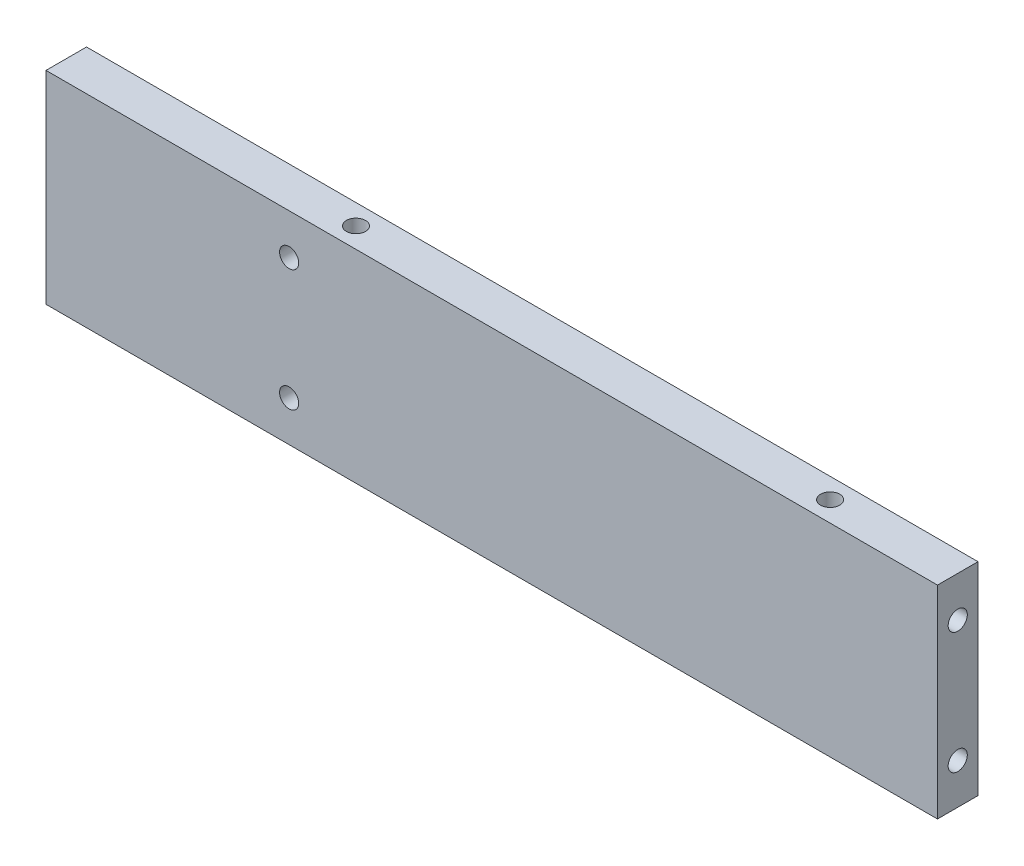
ISO-10303-21;
HEADER;
FILE_DESCRIPTION(('STEP AP214'),'2;1');
FILE_NAME('part.step','',(''),(''),'','','');
FILE_SCHEMA(('AUTOMOTIVE_DESIGN { 1 0 10303 214 1 1 1 1 }'));
ENDSEC;
DATA;
#1=APPLICATION_CONTEXT('core data for automotive mechanical design processes');
#2=APPLICATION_PROTOCOL_DEFINITION('international standard','automotive_design',2000,#1);
#3=PRODUCT_CONTEXT('',#1,'mechanical');
#4=PRODUCT('Part','Part','',(#3));
#5=PRODUCT_RELATED_PRODUCT_CATEGORY('part','',(#4));
#6=PRODUCT_DEFINITION_FORMATION('','',#4);
#7=PRODUCT_DEFINITION_CONTEXT('part definition',#1,'design');
#8=PRODUCT_DEFINITION('design','',#6,#7);
#9=PRODUCT_DEFINITION_SHAPE('','',#8);
#10=(LENGTH_UNIT() NAMED_UNIT(*) SI_UNIT(.MILLI.,.METRE.));
#11=(NAMED_UNIT(*) PLANE_ANGLE_UNIT() SI_UNIT($,.RADIAN.));
#12=(NAMED_UNIT(*) SI_UNIT($,.STERADIAN.) SOLID_ANGLE_UNIT());
#13=UNCERTAINTY_MEASURE_WITH_UNIT(LENGTH_MEASURE(1.E-05),#10,'distance_accuracy_value','');
#14=(GEOMETRIC_REPRESENTATION_CONTEXT(3) GLOBAL_UNCERTAINTY_ASSIGNED_CONTEXT((#13)) GLOBAL_UNIT_ASSIGNED_CONTEXT((#10,
#11,#12)) REPRESENTATION_CONTEXT('',''));
#15=CARTESIAN_POINT('',(0.,0.,0.));
#16=DIRECTION('',(0.,0.,1.));
#17=DIRECTION('',(1.,0.,0.));
#18=AXIS2_PLACEMENT_3D('',#15,#16,#17);
#19=CARTESIAN_POINT('',(0.,31.75,0.));
#20=DIRECTION('',(0.,0.,-1.));
#21=DIRECTION('',(-1.,0.,0.));
#22=AXIS2_PLACEMENT_3D('',#19,#20,#21);
#23=PLANE('',#22);
#24=CARTESIAN_POINT('',(38.1,6.35,0.));
#25=DIRECTION('',(0.,0.,-1.));
#26=DIRECTION('',(-1.,0.,0.));
#27=AXIS2_PLACEMENT_3D('',#24,#25,#26);
#28=CIRCLE('',#27,1.5);
#29=CARTESIAN_POINT('',(36.6,6.35,0.));
#30=VERTEX_POINT('',#29);
#31=EDGE_CURVE('E252',#30,#30,#28,.T.);
#32=ORIENTED_EDGE('',*,*,#31,.F.);
#33=EDGE_LOOP('',(#32));
#34=FACE_BOUND('',#33,.T.);
#35=CARTESIAN_POINT('',(38.1,25.4,0.));
#36=DIRECTION('',(0.,0.,-1.));
#37=DIRECTION('',(-1.,0.,0.));
#38=AXIS2_PLACEMENT_3D('',#35,#36,#37);
#39=CIRCLE('',#38,1.5);
#40=CARTESIAN_POINT('',(36.6,25.4,0.));
#41=VERTEX_POINT('',#40);
#42=EDGE_CURVE('E258',#41,#41,#39,.T.);
#43=ORIENTED_EDGE('',*,*,#42,.F.);
#44=EDGE_LOOP('',(#43));
#45=FACE_BOUND('',#44,.T.);
#46=DIRECTION('',(1.,0.,0.));
#47=VECTOR('',#46,1.);
#48=CARTESIAN_POINT('',(0.,0.,0.));
#49=LINE('',#48,#47);
#50=CARTESIAN_POINT('',(0.,0.,0.));
#51=VERTEX_POINT('',#50);
#52=CARTESIAN_POINT('',(139.7,0.,0.));
#53=VERTEX_POINT('',#52);
#54=EDGE_CURVE('E269',#51,#53,#49,.T.);
#55=ORIENTED_EDGE('',*,*,#54,.F.);
#56=DIRECTION('',(0.,-1.,0.));
#57=VECTOR('',#56,1.);
#58=CARTESIAN_POINT('',(0.,31.75,0.));
#59=LINE('',#58,#57);
#60=CARTESIAN_POINT('',(0.,31.75,0.));
#61=VERTEX_POINT('',#60);
#62=EDGE_CURVE('E277',#61,#51,#59,.T.);
#63=ORIENTED_EDGE('',*,*,#62,.F.);
#64=DIRECTION('',(1.,0.,0.));
#65=VECTOR('',#64,1.);
#66=CARTESIAN_POINT('',(0.,31.75,0.));
#67=LINE('',#66,#65);
#68=CARTESIAN_POINT('',(139.7,31.75,0.));
#69=VERTEX_POINT('',#68);
#70=EDGE_CURVE('E274',#61,#69,#67,.T.);
#71=ORIENTED_EDGE('',*,*,#70,.T.);
#72=DIRECTION('',(0.,-1.,0.));
#73=VECTOR('',#72,1.);
#74=CARTESIAN_POINT('',(139.7,31.75,0.));
#75=LINE('',#74,#73);
#76=EDGE_CURVE('E289',#69,#53,#75,.T.);
#77=ORIENTED_EDGE('',*,*,#76,.T.);
#78=EDGE_LOOP('',(#55,#63,#71,#77));
#79=FACE_BOUND('',#78,.T.);
#80=DIRECTION('',(0.,1.,0.));
#81=VECTOR('',#80,1.);
#82=CARTESIAN_POINT('',(35.56,20.955,0.));
#83=LINE('',#82,#81);
#84=CARTESIAN_POINT('',(35.56,20.955,0.));
#85=VERTEX_POINT('',#84);
#86=CARTESIAN_POINT('',(35.56,23.495,0.));
#87=VERTEX_POINT('',#86);
#88=EDGE_CURVE('E243',#85,#87,#83,.T.);
#89=ORIENTED_EDGE('',*,*,#88,.T.);
#90=CARTESIAN_POINT('',(30.48,23.495,0.));
#91=DIRECTION('',(0.,0.,-1.));
#92=DIRECTION('',(-1.,0.,0.));
#93=AXIS2_PLACEMENT_3D('',#90,#91,#92);
#94=CIRCLE('',#93,5.08);
#95=CARTESIAN_POINT('',(30.48,28.575,0.));
#96=VERTEX_POINT('',#95);
#97=EDGE_CURVE('E11',#87,#96,#94,.F.);
#98=ORIENTED_EDGE('',*,*,#97,.T.);
#99=DIRECTION('',(-1.,0.,0.));
#100=VECTOR('',#99,1.);
#101=CARTESIAN_POINT('',(10.16,28.575,0.));
#102=LINE('',#101,#100);
#103=CARTESIAN_POINT('',(15.24,28.575,0.));
#104=VERTEX_POINT('',#103);
#105=EDGE_CURVE('E216',#96,#104,#102,.T.);
#106=ORIENTED_EDGE('',*,*,#105,.T.);
#107=CARTESIAN_POINT('',(15.24,23.495,0.));
#108=DIRECTION('',(0.,0.,-1.));
#109=DIRECTION('',(-1.,0.,0.));
#110=AXIS2_PLACEMENT_3D('',#107,#108,#109);
#111=CIRCLE('',#110,5.08);
#112=CARTESIAN_POINT('',(10.16,23.495,0.));
#113=VERTEX_POINT('',#112);
#114=EDGE_CURVE('E333',#104,#113,#111,.F.);
#115=ORIENTED_EDGE('',*,*,#114,.T.);
#116=DIRECTION('',(0.,-1.,0.));
#117=VECTOR('',#116,1.);
#118=CARTESIAN_POINT('',(10.16,28.575,0.));
#119=LINE('',#118,#117);
#120=CARTESIAN_POINT('',(10.16,8.25500000000001,0.));
#121=VERTEX_POINT('',#120);
#122=EDGE_CURVE('E211',#113,#121,#119,.T.);
#123=ORIENTED_EDGE('',*,*,#122,.T.);
#124=CARTESIAN_POINT('',(15.24,8.25500000000001,0.));
#125=DIRECTION('',(0.,0.,-1.));
#126=DIRECTION('',(-1.,0.,0.));
#127=AXIS2_PLACEMENT_3D('',#124,#125,#126);
#128=CIRCLE('',#127,5.08);
#129=CARTESIAN_POINT('',(15.24,3.175,0.));
#130=VERTEX_POINT('',#129);
#131=EDGE_CURVE('E331',#121,#130,#128,.F.);
#132=ORIENTED_EDGE('',*,*,#131,.T.);
#133=DIRECTION('',(1.,0.,0.));
#134=VECTOR('',#133,1.);
#135=CARTESIAN_POINT('',(10.16,3.175,0.));
#136=LINE('',#135,#134);
#137=CARTESIAN_POINT('',(30.48,3.175,0.));
#138=VERTEX_POINT('',#137);
#139=EDGE_CURVE('E234',#130,#138,#136,.T.);
#140=ORIENTED_EDGE('',*,*,#139,.T.);
#141=CARTESIAN_POINT('',(30.48,8.255,0.));
#142=DIRECTION('',(0.,0.,-1.));
#143=DIRECTION('',(-1.,0.,0.));
#144=AXIS2_PLACEMENT_3D('',#141,#142,#143);
#145=CIRCLE('',#144,5.08);
#146=CARTESIAN_POINT('',(35.56,8.255,0.));
#147=VERTEX_POINT('',#146);
#148=EDGE_CURVE('E335',#138,#147,#145,.F.);
#149=ORIENTED_EDGE('',*,*,#148,.T.);
#150=DIRECTION('',(0.,1.,0.));
#151=VECTOR('',#150,1.);
#152=CARTESIAN_POINT('',(35.56,10.795,0.));
#153=LINE('',#152,#151);
#154=CARTESIAN_POINT('',(35.56,10.795,0.));
#155=VERTEX_POINT('',#154);
#156=EDGE_CURVE('E237',#147,#155,#153,.T.);
#157=ORIENTED_EDGE('',*,*,#156,.T.);
#158=CARTESIAN_POINT('',(33.02,15.1944090512249,0.));
#159=DIRECTION('',(0.,0.,-1.));
#160=DIRECTION('',(-1.,0.,0.));
#161=AXIS2_PLACEMENT_3D('',#158,#159,#160);
#162=CIRCLE('',#161,5.08);
#163=CARTESIAN_POINT('',(38.1,15.1944090512249,0.));
#164=VERTEX_POINT('',#163);
#165=EDGE_CURVE('E337',#155,#164,#162,.F.);
#166=ORIENTED_EDGE('',*,*,#165,.T.);
#167=DIRECTION('',(0.,1.,0.));
#168=VECTOR('',#167,1.);
#169=CARTESIAN_POINT('',(38.1,20.955,0.));
#170=LINE('',#169,#168);
#171=CARTESIAN_POINT('',(38.1,16.5555909487751,0.));
#172=VERTEX_POINT('',#171);
#173=EDGE_CURVE('E240',#164,#172,#170,.T.);
#174=ORIENTED_EDGE('',*,*,#173,.T.);
#175=CARTESIAN_POINT('',(33.02,16.5555909487751,0.));
#176=DIRECTION('',(0.,0.,-1.));
#177=DIRECTION('',(-1.,0.,0.));
#178=AXIS2_PLACEMENT_3D('',#175,#176,#177);
#179=CIRCLE('',#178,5.08);
#180=EDGE_CURVE('E46',#172,#85,#179,.F.);
#181=ORIENTED_EDGE('',*,*,#180,.T.);
#182=EDGE_LOOP('',(#89,#98,#106,#115,#123,#132,#140,#149,#157,#166,#174,#181));
#183=FACE_BOUND('',#182,.T.);
#184=ADVANCED_FACE('F38',(#34,#45,#79,#183),#23,.T.);
#185=CARTESIAN_POINT('',(0.,31.75,0.));
#186=DIRECTION('',(1.,0.,0.));
#187=DIRECTION('',(0.,0.,-1.));
#188=AXIS2_PLACEMENT_3D('',#185,#186,#187);
#189=PLANE('',#188);
#190=CARTESIAN_POINT('',(0.,25.4,3.175));
#191=DIRECTION('',(-1.,0.,0.));
#192=DIRECTION('',(0.,0.,1.));
#193=AXIS2_PLACEMENT_3D('',#190,#191,#192);
#194=CIRCLE('',#193,1.5);
#195=CARTESIAN_POINT('',(0.,25.4,4.675));
#196=VERTEX_POINT('',#195);
#197=EDGE_CURVE('E199',#196,#196,#194,.T.);
#198=ORIENTED_EDGE('',*,*,#197,.F.);
#199=EDGE_LOOP('',(#198));
#200=FACE_BOUND('',#199,.T.);
#201=CARTESIAN_POINT('',(0.,6.35,3.175));
#202=DIRECTION('',(-1.,0.,0.));
#203=DIRECTION('',(0.,0.,1.));
#204=AXIS2_PLACEMENT_3D('',#201,#202,#203);
#205=CIRCLE('',#204,1.5);
#206=CARTESIAN_POINT('',(0.,6.35,4.675));
#207=VERTEX_POINT('',#206);
#208=EDGE_CURVE('E205',#207,#207,#205,.T.);
#209=ORIENTED_EDGE('',*,*,#208,.F.);
#210=EDGE_LOOP('',(#209));
#211=FACE_BOUND('',#210,.T.);
#212=DIRECTION('',(0.,0.,1.));
#213=VECTOR('',#212,1.);
#214=CARTESIAN_POINT('',(0.,0.,0.));
#215=LINE('',#214,#213);
#216=CARTESIAN_POINT('',(0.,0.,6.35));
#217=VERTEX_POINT('',#216);
#218=EDGE_CURVE('E264',#51,#217,#215,.T.);
#219=ORIENTED_EDGE('',*,*,#218,.T.);
#220=DIRECTION('',(0.,-1.,0.));
#221=VECTOR('',#220,1.);
#222=CARTESIAN_POINT('',(0.,31.75,6.35));
#223=LINE('',#222,#221);
#224=CARTESIAN_POINT('',(0.,31.75,6.35));
#225=VERTEX_POINT('',#224);
#226=EDGE_CURVE('E293',#225,#217,#223,.T.);
#227=ORIENTED_EDGE('',*,*,#226,.F.);
#228=DIRECTION('',(0.,0.,1.));
#229=VECTOR('',#228,1.);
#230=CARTESIAN_POINT('',(0.,31.75,0.));
#231=LINE('',#230,#229);
#232=EDGE_CURVE('E265',#61,#225,#231,.T.);
#233=ORIENTED_EDGE('',*,*,#232,.F.);
#234=ORIENTED_EDGE('',*,*,#62,.T.);
#235=EDGE_LOOP('',(#219,#227,#233,#234));
#236=FACE_BOUND('',#235,.T.);
#237=ADVANCED_FACE('F398',(#200,#211,#236),#189,.F.);
#238=CARTESIAN_POINT('',(0.,31.75,6.35));
#239=DIRECTION('',(0.,0.,-1.));
#240=DIRECTION('',(-1.,0.,0.));
#241=AXIS2_PLACEMENT_3D('',#238,#239,#240);
#242=PLANE('',#241);
#243=CARTESIAN_POINT('',(38.1,6.35,6.35));
#244=DIRECTION('',(0.,0.,-1.));
#245=DIRECTION('',(-1.,0.,0.));
#246=AXIS2_PLACEMENT_3D('',#243,#244,#245);
#247=CIRCLE('',#246,1.5);
#248=CARTESIAN_POINT('',(36.6,6.35,6.35));
#249=VERTEX_POINT('',#248);
#250=EDGE_CURVE('E255',#249,#249,#247,.T.);
#251=ORIENTED_EDGE('',*,*,#250,.T.);
#252=EDGE_LOOP('',(#251));
#253=FACE_BOUND('',#252,.T.);
#254=CARTESIAN_POINT('',(38.1,25.4,6.35));
#255=DIRECTION('',(0.,0.,-1.));
#256=DIRECTION('',(-1.,0.,0.));
#257=AXIS2_PLACEMENT_3D('',#254,#255,#256);
#258=CIRCLE('',#257,1.5);
#259=CARTESIAN_POINT('',(36.6,25.4,6.35));
#260=VERTEX_POINT('',#259);
#261=EDGE_CURVE('E261',#260,#260,#258,.T.);
#262=ORIENTED_EDGE('',*,*,#261,.T.);
#263=EDGE_LOOP('',(#262));
#264=FACE_BOUND('',#263,.T.);
#265=DIRECTION('',(1.,0.,0.));
#266=VECTOR('',#265,1.);
#267=CARTESIAN_POINT('',(0.,0.,6.35));
#268=LINE('',#267,#266);
#269=CARTESIAN_POINT('',(139.7,0.,6.35));
#270=VERTEX_POINT('',#269);
#271=EDGE_CURVE('E280',#217,#270,#268,.T.);
#272=ORIENTED_EDGE('',*,*,#271,.T.);
#273=DIRECTION('',(0.,-1.,0.));
#274=VECTOR('',#273,1.);
#275=CARTESIAN_POINT('',(139.7,31.75,6.35));
#276=LINE('',#275,#274);
#277=CARTESIAN_POINT('',(139.7,31.75,6.35));
#278=VERTEX_POINT('',#277);
#279=EDGE_CURVE('E291',#278,#270,#276,.T.);
#280=ORIENTED_EDGE('',*,*,#279,.F.);
#281=DIRECTION('',(1.,0.,0.));
#282=VECTOR('',#281,1.);
#283=CARTESIAN_POINT('',(0.,31.75,6.35));
#284=LINE('',#283,#282);
#285=EDGE_CURVE('E268',#225,#278,#284,.T.);
#286=ORIENTED_EDGE('',*,*,#285,.F.);
#287=ORIENTED_EDGE('',*,*,#226,.T.);
#288=EDGE_LOOP('',(#272,#280,#286,#287));
#289=FACE_BOUND('',#288,.T.);
#290=ADVANCED_FACE('F404',(#253,#264,#289),#242,.F.);
#291=CARTESIAN_POINT('',(139.7,31.75,0.));
#292=DIRECTION('',(1.,0.,0.));
#293=DIRECTION('',(0.,0.,-1.));
#294=AXIS2_PLACEMENT_3D('',#291,#292,#293);
#295=PLANE('',#294);
#296=CARTESIAN_POINT('',(139.7,25.4,3.17499999999999));
#297=DIRECTION('',(1.,0.,0.));
#298=DIRECTION('',(0.,0.,-1.));
#299=AXIS2_PLACEMENT_3D('',#296,#297,#298);
#300=CIRCLE('',#299,1.5);
#301=CARTESIAN_POINT('',(139.7,25.4,1.67499999999999));
#302=VERTEX_POINT('',#301);
#303=EDGE_CURVE('E187',#302,#302,#300,.T.);
#304=ORIENTED_EDGE('',*,*,#303,.F.);
#305=EDGE_LOOP('',(#304));
#306=FACE_BOUND('',#305,.T.);
#307=CARTESIAN_POINT('',(139.7,6.35,3.17499999999999));
#308=DIRECTION('',(1.,0.,0.));
#309=DIRECTION('',(0.,0.,-1.));
#310=AXIS2_PLACEMENT_3D('',#307,#308,#309);
#311=CIRCLE('',#310,1.5);
#312=CARTESIAN_POINT('',(139.7,6.35,1.67499999999999));
#313=VERTEX_POINT('',#312);
#314=EDGE_CURVE('E193',#313,#313,#311,.T.);
#315=ORIENTED_EDGE('',*,*,#314,.F.);
#316=EDGE_LOOP('',(#315));
#317=FACE_BOUND('',#316,.T.);
#318=DIRECTION('',(0.,0.,1.));
#319=VECTOR('',#318,1.);
#320=CARTESIAN_POINT('',(139.7,0.,0.));
#321=LINE('',#320,#319);
#322=EDGE_CURVE('E283',#53,#270,#321,.T.);
#323=ORIENTED_EDGE('',*,*,#322,.F.);
#324=ORIENTED_EDGE('',*,*,#76,.F.);
#325=DIRECTION('',(0.,0.,1.));
#326=VECTOR('',#325,1.);
#327=CARTESIAN_POINT('',(139.7,31.75,0.));
#328=LINE('',#327,#326);
#329=EDGE_CURVE('E271',#69,#278,#328,.T.);
#330=ORIENTED_EDGE('',*,*,#329,.T.);
#331=ORIENTED_EDGE('',*,*,#279,.T.);
#332=EDGE_LOOP('',(#323,#324,#330,#331));
#333=FACE_BOUND('',#332,.T.);
#334=ADVANCED_FACE('F413',(#306,#317,#333),#295,.T.);
#335=CARTESIAN_POINT('',(0.,31.75,0.));
#336=DIRECTION('',(0.,1.,0.));
#337=DIRECTION('',(0.,0.,1.));
#338=AXIS2_PLACEMENT_3D('',#335,#336,#337);
#339=PLANE('',#338);
#340=CARTESIAN_POINT('',(119.7,31.75,3.17500000000003));
#341=DIRECTION('',(0.,1.,0.));
#342=DIRECTION('',(0.,0.,1.));
#343=AXIS2_PLACEMENT_3D('',#340,#341,#342);
#344=CIRCLE('',#343,1.49999999999999);
#345=CARTESIAN_POINT('',(119.7,31.75,4.67500000000001));
#346=VERTEX_POINT('',#345);
#347=EDGE_CURVE('E177',#346,#346,#344,.T.);
#348=ORIENTED_EDGE('',*,*,#347,.F.);
#349=EDGE_LOOP('',(#348));
#350=FACE_BOUND('',#349,.T.);
#351=CARTESIAN_POINT('',(45.4,31.75,3.17500000000002));
#352=DIRECTION('',(0.,1.,0.));
#353=DIRECTION('',(0.,0.,1.));
#354=AXIS2_PLACEMENT_3D('',#351,#352,#353);
#355=CIRCLE('',#354,1.49999999999999);
#356=CARTESIAN_POINT('',(45.4,31.75,4.67500000000001));
#357=VERTEX_POINT('',#356);
#358=EDGE_CURVE('E176',#357,#357,#355,.T.);
#359=ORIENTED_EDGE('',*,*,#358,.F.);
#360=EDGE_LOOP('',(#359));
#361=FACE_BOUND('',#360,.T.);
#362=ORIENTED_EDGE('',*,*,#232,.T.);
#363=ORIENTED_EDGE('',*,*,#285,.T.);
#364=ORIENTED_EDGE('',*,*,#329,.F.);
#365=ORIENTED_EDGE('',*,*,#70,.F.);
#366=EDGE_LOOP('',(#362,#363,#364,#365));
#367=FACE_BOUND('',#366,.T.);
#368=ADVANCED_FACE('F416',(#350,#361,#367),#339,.T.);
#369=CARTESIAN_POINT('',(0.,0.,0.));
#370=DIRECTION('',(0.,1.,0.));
#371=DIRECTION('',(0.,0.,1.));
#372=AXIS2_PLACEMENT_3D('',#369,#370,#371);
#373=PLANE('',#372);
#374=ORIENTED_EDGE('',*,*,#218,.F.);
#375=ORIENTED_EDGE('',*,*,#54,.T.);
#376=ORIENTED_EDGE('',*,*,#322,.T.);
#377=ORIENTED_EDGE('',*,*,#271,.F.);
#378=EDGE_LOOP('',(#374,#375,#376,#377));
#379=FACE_BOUND('',#378,.T.);
#380=ADVANCED_FACE('F411',(#379),#373,.F.);
#381=CARTESIAN_POINT('',(38.1,25.4,0.));
#382=DIRECTION('',(0.,0.,-1.));
#383=DIRECTION('',(-1.,0.,0.));
#384=AXIS2_PLACEMENT_3D('',#381,#382,#383);
#385=CYLINDRICAL_SURFACE('',#384,1.5);
#386=ORIENTED_EDGE('',*,*,#261,.F.);
#387=EDGE_LOOP('',(#386));
#388=FACE_BOUND('',#387,.T.);
#389=ORIENTED_EDGE('',*,*,#42,.T.);
#390=EDGE_LOOP('',(#389));
#391=FACE_BOUND('',#390,.T.);
#392=ADVANCED_FACE('F692',(#388,#391),#385,.F.);
#393=CARTESIAN_POINT('',(38.1,6.35,0.));
#394=DIRECTION('',(0.,0.,-1.));
#395=DIRECTION('',(-1.,0.,0.));
#396=AXIS2_PLACEMENT_3D('',#393,#394,#395);
#397=CYLINDRICAL_SURFACE('',#396,1.5);
#398=ORIENTED_EDGE('',*,*,#250,.F.);
#399=EDGE_LOOP('',(#398));
#400=FACE_BOUND('',#399,.T.);
#401=ORIENTED_EDGE('',*,*,#31,.T.);
#402=EDGE_LOOP('',(#401));
#403=FACE_BOUND('',#402,.T.);
#404=ADVANCED_FACE('F676',(#400,#403),#397,.F.);
#405=CARTESIAN_POINT('',(10.16,28.575,3.81));
#406=DIRECTION('',(1.,0.,0.));
#407=DIRECTION('',(0.,0.,-1.));
#408=AXIS2_PLACEMENT_3D('',#405,#406,#407);
#409=PLANE('',#408);
#410=DIRECTION('',(0.,-1.,0.));
#411=VECTOR('',#410,1.);
#412=CARTESIAN_POINT('',(10.16,28.575,3.81));
#413=LINE('',#412,#411);
#414=CARTESIAN_POINT('',(10.16,23.495,3.81));
#415=VERTEX_POINT('',#414);
#416=CARTESIAN_POINT('',(10.16,8.25500000000001,3.81));
#417=VERTEX_POINT('',#416);
#418=EDGE_CURVE('E212',#415,#417,#413,.T.);
#419=ORIENTED_EDGE('',*,*,#418,.T.);
#420=DIRECTION('',(0.,0.,-1.));
#421=VECTOR('',#420,1.);
#422=CARTESIAN_POINT('',(10.16,8.25500000000001,0.));
#423=LINE('',#422,#421);
#424=EDGE_CURVE('E298',#417,#121,#423,.T.);
#425=ORIENTED_EDGE('',*,*,#424,.T.);
#426=ORIENTED_EDGE('',*,*,#122,.F.);
#427=DIRECTION('',(0.,0.,-1.));
#428=VECTOR('',#427,1.);
#429=CARTESIAN_POINT('',(10.16,23.495,3.81));
#430=LINE('',#429,#428);
#431=EDGE_CURVE('E296',#113,#415,#430,.F.);
#432=ORIENTED_EDGE('',*,*,#431,.T.);
#433=EDGE_LOOP('',(#419,#425,#426,#432));
#434=FACE_BOUND('',#433,.T.);
#435=ADVANCED_FACE('F377',(#434),#409,.T.);
#436=CARTESIAN_POINT('',(10.16,3.175,3.81));
#437=DIRECTION('',(0.,1.,0.));
#438=DIRECTION('',(0.,0.,1.));
#439=AXIS2_PLACEMENT_3D('',#436,#437,#438);
#440=PLANE('',#439);
#441=ORIENTED_EDGE('',*,*,#139,.F.);
#442=DIRECTION('',(0.,0.,-1.));
#443=VECTOR('',#442,1.);
#444=CARTESIAN_POINT('',(15.24,3.175,3.81));
#445=LINE('',#444,#443);
#446=CARTESIAN_POINT('',(15.24,3.175,3.81));
#447=VERTEX_POINT('',#446);
#448=EDGE_CURVE('E304',#130,#447,#445,.F.);
#449=ORIENTED_EDGE('',*,*,#448,.T.);
#450=DIRECTION('',(1.,0.,0.));
#451=VECTOR('',#450,1.);
#452=CARTESIAN_POINT('',(10.16,3.175,3.81));
#453=LINE('',#452,#451);
#454=CARTESIAN_POINT('',(30.48,3.175,3.81));
#455=VERTEX_POINT('',#454);
#456=EDGE_CURVE('E215',#447,#455,#453,.T.);
#457=ORIENTED_EDGE('',*,*,#456,.T.);
#458=DIRECTION('',(0.,0.,-1.));
#459=VECTOR('',#458,1.);
#460=CARTESIAN_POINT('',(30.48,3.175,0.));
#461=LINE('',#460,#459);
#462=EDGE_CURVE('E301',#455,#138,#461,.T.);
#463=ORIENTED_EDGE('',*,*,#462,.T.);
#464=EDGE_LOOP('',(#441,#449,#457,#463));
#465=FACE_BOUND('',#464,.T.);
#466=ADVANCED_FACE('F369',(#465),#440,.T.);
#467=CARTESIAN_POINT('',(35.56,10.795,3.81));
#468=DIRECTION('',(-1.,0.,0.));
#469=DIRECTION('',(0.,0.,1.));
#470=AXIS2_PLACEMENT_3D('',#467,#468,#469);
#471=PLANE('',#470);
#472=ORIENTED_EDGE('',*,*,#156,.F.);
#473=DIRECTION('',(0.,0.,-1.));
#474=VECTOR('',#473,1.);
#475=CARTESIAN_POINT('',(35.56,8.255,3.81));
#476=LINE('',#475,#474);
#477=CARTESIAN_POINT('',(35.56,8.255,3.81));
#478=VERTEX_POINT('',#477);
#479=EDGE_CURVE('E323',#147,#478,#476,.F.);
#480=ORIENTED_EDGE('',*,*,#479,.T.);
#481=DIRECTION('',(0.,1.,0.));
#482=VECTOR('',#481,1.);
#483=CARTESIAN_POINT('',(35.56,10.795,3.81));
#484=LINE('',#483,#482);
#485=CARTESIAN_POINT('',(35.56,10.795,3.81));
#486=VERTEX_POINT('',#485);
#487=EDGE_CURVE('E219',#478,#486,#484,.T.);
#488=ORIENTED_EDGE('',*,*,#487,.T.);
#489=DIRECTION('',(0.,0.,-1.));
#490=VECTOR('',#489,1.);
#491=CARTESIAN_POINT('',(35.56,10.795,3.81));
#492=LINE('',#491,#490);
#493=EDGE_CURVE('E249',#486,#155,#492,.T.);
#494=ORIENTED_EDGE('',*,*,#493,.T.);
#495=EDGE_LOOP('',(#472,#480,#488,#494));
#496=FACE_BOUND('',#495,.T.);
#497=ADVANCED_FACE('F361',(#496),#471,.T.);
#498=CARTESIAN_POINT('',(38.1,20.955,3.81));
#499=DIRECTION('',(-1.,0.,0.));
#500=DIRECTION('',(0.,0.,1.));
#501=AXIS2_PLACEMENT_3D('',#498,#499,#500);
#502=PLANE('',#501);
#503=ORIENTED_EDGE('',*,*,#173,.F.);
#504=DIRECTION('',(0.,0.,-1.));
#505=VECTOR('',#504,1.);
#506=CARTESIAN_POINT('',(38.1,15.1944090512249,3.81));
#507=LINE('',#506,#505);
#508=CARTESIAN_POINT('',(38.1,15.1944090512249,3.81));
#509=VERTEX_POINT('',#508);
#510=EDGE_CURVE('E327',#164,#509,#507,.F.);
#511=ORIENTED_EDGE('',*,*,#510,.T.);
#512=DIRECTION('',(0.,1.,0.));
#513=VECTOR('',#512,1.);
#514=CARTESIAN_POINT('',(38.1,20.955,3.81));
#515=LINE('',#514,#513);
#516=CARTESIAN_POINT('',(38.1,16.5555909487751,3.81));
#517=VERTEX_POINT('',#516);
#518=EDGE_CURVE('E222',#509,#517,#515,.T.);
#519=ORIENTED_EDGE('',*,*,#518,.T.);
#520=DIRECTION('',(0.,0.,1.));
#521=VECTOR('',#520,1.);
#522=CARTESIAN_POINT('',(38.1,16.5555909487751,0.));
#523=LINE('',#522,#521);
#524=EDGE_CURVE('E325',#517,#172,#523,.F.);
#525=ORIENTED_EDGE('',*,*,#524,.T.);
#526=EDGE_LOOP('',(#503,#511,#519,#525));
#527=FACE_BOUND('',#526,.T.);
#528=ADVANCED_FACE('F352',(#527),#502,.T.);
#529=CARTESIAN_POINT('',(35.56,20.955,3.81));
#530=DIRECTION('',(-1.,0.,0.));
#531=DIRECTION('',(0.,0.,1.));
#532=AXIS2_PLACEMENT_3D('',#529,#530,#531);
#533=PLANE('',#532);
#534=DIRECTION('',(0.,1.,0.));
#535=VECTOR('',#534,1.);
#536=CARTESIAN_POINT('',(35.56,20.955,3.81));
#537=LINE('',#536,#535);
#538=CARTESIAN_POINT('',(35.56,20.955,3.81));
#539=VERTEX_POINT('',#538);
#540=CARTESIAN_POINT('',(35.56,23.495,3.81));
#541=VERTEX_POINT('',#540);
#542=EDGE_CURVE('E225',#539,#541,#537,.T.);
#543=ORIENTED_EDGE('',*,*,#542,.T.);
#544=DIRECTION('',(0.,0.,-1.));
#545=VECTOR('',#544,1.);
#546=CARTESIAN_POINT('',(35.56,23.495,0.));
#547=LINE('',#546,#545);
#548=EDGE_CURVE('E329',#541,#87,#547,.T.);
#549=ORIENTED_EDGE('',*,*,#548,.T.);
#550=ORIENTED_EDGE('',*,*,#88,.F.);
#551=DIRECTION('',(0.,0.,-1.));
#552=VECTOR('',#551,1.);
#553=CARTESIAN_POINT('',(35.56,20.955,3.81));
#554=LINE('',#553,#552);
#555=EDGE_CURVE('E231',#539,#85,#554,.T.);
#556=ORIENTED_EDGE('',*,*,#555,.F.);
#557=EDGE_LOOP('',(#543,#549,#550,#556));
#558=FACE_BOUND('',#557,.T.);
#559=ADVANCED_FACE('F342',(#558),#533,.T.);
#560=CARTESIAN_POINT('',(10.16,28.575,3.81));
#561=DIRECTION('',(0.,-1.,0.));
#562=DIRECTION('',(0.,0.,-1.));
#563=AXIS2_PLACEMENT_3D('',#560,#561,#562);
#564=PLANE('',#563);
#565=DIRECTION('',(-1.,0.,0.));
#566=VECTOR('',#565,1.);
#567=CARTESIAN_POINT('',(10.16,28.575,3.81));
#568=LINE('',#567,#566);
#569=CARTESIAN_POINT('',(30.48,28.575,3.81));
#570=VERTEX_POINT('',#569);
#571=CARTESIAN_POINT('',(15.24,28.575,3.81));
#572=VERTEX_POINT('',#571);
#573=EDGE_CURVE('E228',#570,#572,#568,.T.);
#574=ORIENTED_EDGE('',*,*,#573,.T.);
#575=DIRECTION('',(0.,0.,-1.));
#576=VECTOR('',#575,1.);
#577=CARTESIAN_POINT('',(15.24,28.575,0.));
#578=LINE('',#577,#576);
#579=EDGE_CURVE('E320',#572,#104,#578,.T.);
#580=ORIENTED_EDGE('',*,*,#579,.T.);
#581=ORIENTED_EDGE('',*,*,#105,.F.);
#582=DIRECTION('',(0.,0.,-1.));
#583=VECTOR('',#582,1.);
#584=CARTESIAN_POINT('',(30.48,28.575,3.81));
#585=LINE('',#584,#583);
#586=EDGE_CURVE('E318',#96,#570,#585,.F.);
#587=ORIENTED_EDGE('',*,*,#586,.T.);
#588=EDGE_LOOP('',(#574,#580,#581,#587));
#589=FACE_BOUND('',#588,.T.);
#590=ADVANCED_FACE('F386',(#589),#564,.T.);
#591=CARTESIAN_POINT('',(0.,0.,3.81));
#592=DIRECTION('',(0.,0.,1.));
#593=DIRECTION('',(1.,0.,0.));
#594=AXIS2_PLACEMENT_3D('',#591,#592,#593);
#595=PLANE('',#594);
#596=ORIENTED_EDGE('',*,*,#456,.F.);
#597=CARTESIAN_POINT('',(15.24,8.25500000000001,3.81));
#598=DIRECTION('',(0.,0.,1.));
#599=DIRECTION('',(1.,0.,0.));
#600=AXIS2_PLACEMENT_3D('',#597,#598,#599);
#601=CIRCLE('',#600,5.08);
#602=EDGE_CURVE('E316',#447,#417,#601,.F.);
#603=ORIENTED_EDGE('',*,*,#602,.T.);
#604=ORIENTED_EDGE('',*,*,#418,.F.);
#605=CARTESIAN_POINT('',(15.24,23.495,3.81));
#606=DIRECTION('',(0.,0.,1.));
#607=DIRECTION('',(1.,0.,0.));
#608=AXIS2_PLACEMENT_3D('',#605,#606,#607);
#609=CIRCLE('',#608,5.08);
#610=EDGE_CURVE('E314',#415,#572,#609,.F.);
#611=ORIENTED_EDGE('',*,*,#610,.T.);
#612=ORIENTED_EDGE('',*,*,#573,.F.);
#613=CARTESIAN_POINT('',(30.48,23.495,3.81));
#614=DIRECTION('',(0.,0.,1.));
#615=DIRECTION('',(1.,0.,0.));
#616=AXIS2_PLACEMENT_3D('',#613,#614,#615);
#617=CIRCLE('',#616,5.08);
#618=EDGE_CURVE('E306',#570,#541,#617,.F.);
#619=ORIENTED_EDGE('',*,*,#618,.T.);
#620=ORIENTED_EDGE('',*,*,#542,.F.);
#621=CARTESIAN_POINT('',(33.02,16.5555909487751,3.81));
#622=DIRECTION('',(0.,0.,1.));
#623=DIRECTION('',(1.,0.,0.));
#624=AXIS2_PLACEMENT_3D('',#621,#622,#623);
#625=CIRCLE('',#624,5.08);
#626=EDGE_CURVE('E308',#539,#517,#625,.F.);
#627=ORIENTED_EDGE('',*,*,#626,.T.);
#628=ORIENTED_EDGE('',*,*,#518,.F.);
#629=CARTESIAN_POINT('',(33.02,15.1944090512249,3.81));
#630=DIRECTION('',(0.,0.,1.));
#631=DIRECTION('',(1.,0.,0.));
#632=AXIS2_PLACEMENT_3D('',#629,#630,#631);
#633=CIRCLE('',#632,5.08);
#634=EDGE_CURVE('E310',#509,#486,#633,.F.);
#635=ORIENTED_EDGE('',*,*,#634,.T.);
#636=ORIENTED_EDGE('',*,*,#487,.F.);
#637=CARTESIAN_POINT('',(30.48,8.255,3.81));
#638=DIRECTION('',(0.,0.,1.));
#639=DIRECTION('',(1.,0.,0.));
#640=AXIS2_PLACEMENT_3D('',#637,#638,#639);
#641=CIRCLE('',#640,5.08);
#642=EDGE_CURVE('E312',#478,#455,#641,.F.);
#643=ORIENTED_EDGE('',*,*,#642,.T.);
#644=EDGE_LOOP('',(#596,#603,#604,#611,#612,#619,#620,#627,#628,#635,#636,#643));
#645=FACE_BOUND('',#644,.T.);
#646=ADVANCED_FACE('F349',(#645),#595,.F.);
#647=CARTESIAN_POINT('',(15.24,8.25500000000001,3.81));
#648=DIRECTION('',(0.,0.,1.));
#649=DIRECTION('',(1.,0.,0.));
#650=AXIS2_PLACEMENT_3D('',#647,#648,#649);
#651=CYLINDRICAL_SURFACE('',#650,5.08);
#652=ORIENTED_EDGE('',*,*,#602,.F.);
#653=ORIENTED_EDGE('',*,*,#448,.F.);
#654=ORIENTED_EDGE('',*,*,#131,.F.);
#655=ORIENTED_EDGE('',*,*,#424,.F.);
#656=EDGE_LOOP('',(#652,#653,#654,#655));
#657=FACE_BOUND('',#656,.T.);
#658=ADVANCED_FACE('F372',(#657),#651,.F.);
#659=CARTESIAN_POINT('',(15.24,23.495,3.81));
#660=DIRECTION('',(0.,0.,1.));
#661=DIRECTION('',(1.,0.,0.));
#662=AXIS2_PLACEMENT_3D('',#659,#660,#661);
#663=CYLINDRICAL_SURFACE('',#662,5.08);
#664=ORIENTED_EDGE('',*,*,#610,.F.);
#665=ORIENTED_EDGE('',*,*,#431,.F.);
#666=ORIENTED_EDGE('',*,*,#114,.F.);
#667=ORIENTED_EDGE('',*,*,#579,.F.);
#668=EDGE_LOOP('',(#664,#665,#666,#667));
#669=FACE_BOUND('',#668,.T.);
#670=ADVANCED_FACE('F381',(#669),#663,.F.);
#671=CARTESIAN_POINT('',(30.48,8.255,3.81));
#672=DIRECTION('',(0.,0.,1.));
#673=DIRECTION('',(1.,0.,0.));
#674=AXIS2_PLACEMENT_3D('',#671,#672,#673);
#675=CYLINDRICAL_SURFACE('',#674,5.08);
#676=ORIENTED_EDGE('',*,*,#642,.F.);
#677=ORIENTED_EDGE('',*,*,#479,.F.);
#678=ORIENTED_EDGE('',*,*,#148,.F.);
#679=ORIENTED_EDGE('',*,*,#462,.F.);
#680=EDGE_LOOP('',(#676,#677,#678,#679));
#681=FACE_BOUND('',#680,.T.);
#682=ADVANCED_FACE('F364',(#681),#675,.F.);
#683=CARTESIAN_POINT('',(33.02,15.1944090512249,3.81));
#684=DIRECTION('',(0.,0.,1.));
#685=DIRECTION('',(1.,0.,0.));
#686=AXIS2_PLACEMENT_3D('',#683,#684,#685);
#687=CYLINDRICAL_SURFACE('',#686,5.08);
#688=ORIENTED_EDGE('',*,*,#634,.F.);
#689=ORIENTED_EDGE('',*,*,#510,.F.);
#690=ORIENTED_EDGE('',*,*,#165,.F.);
#691=ORIENTED_EDGE('',*,*,#493,.F.);
#692=EDGE_LOOP('',(#688,#689,#690,#691));
#693=FACE_BOUND('',#692,.T.);
#694=ADVANCED_FACE('F355',(#693),#687,.F.);
#695=CARTESIAN_POINT('',(33.02,16.5555909487751,3.81));
#696=DIRECTION('',(0.,0.,-1.));
#697=DIRECTION('',(-1.,0.,0.));
#698=AXIS2_PLACEMENT_3D('',#695,#696,#697);
#699=CYLINDRICAL_SURFACE('',#698,5.08);
#700=ORIENTED_EDGE('',*,*,#626,.F.);
#701=ORIENTED_EDGE('',*,*,#555,.T.);
#702=ORIENTED_EDGE('',*,*,#180,.F.);
#703=ORIENTED_EDGE('',*,*,#524,.F.);
#704=EDGE_LOOP('',(#700,#701,#702,#703));
#705=FACE_BOUND('',#704,.T.);
#706=ADVANCED_FACE('F345',(#705),#699,.F.);
#707=CARTESIAN_POINT('',(30.48,23.495,3.81));
#708=DIRECTION('',(0.,0.,1.));
#709=DIRECTION('',(1.,0.,0.));
#710=AXIS2_PLACEMENT_3D('',#707,#708,#709);
#711=CYLINDRICAL_SURFACE('',#710,5.08);
#712=ORIENTED_EDGE('',*,*,#618,.F.);
#713=ORIENTED_EDGE('',*,*,#586,.F.);
#714=ORIENTED_EDGE('',*,*,#97,.F.);
#715=ORIENTED_EDGE('',*,*,#548,.F.);
#716=EDGE_LOOP('',(#712,#713,#714,#715));
#717=FACE_BOUND('',#716,.T.);
#718=ADVANCED_FACE('F40',(#717),#711,.F.);
#719=CARTESIAN_POINT('',(7.62,6.35,3.175));
#720=DIRECTION('',(-1.,0.,0.));
#721=DIRECTION('',(0.,0.,1.));
#722=AXIS2_PLACEMENT_3D('',#719,#720,#721);
#723=CONICAL_SURFACE('',#722,1.5,1.02974425867665);
#724=CARTESIAN_POINT('',(8.52129092854134,6.35,3.175));
#725=VERTEX_POINT('',#724);
#726=VERTEX_LOOP('',#725);
#727=FACE_BOUND('',#726,.T.);
#728=CARTESIAN_POINT('',(7.62,6.35,3.175));
#729=DIRECTION('',(-1.,0.,0.));
#730=DIRECTION('',(0.,0.,1.));
#731=AXIS2_PLACEMENT_3D('',#728,#729,#730);
#732=CIRCLE('',#731,1.5);
#733=CARTESIAN_POINT('',(7.62,6.35,4.675));
#734=VERTEX_POINT('',#733);
#735=EDGE_CURVE('E208',#734,#734,#732,.T.);
#736=ORIENTED_EDGE('',*,*,#735,.T.);
#737=EDGE_LOOP('',(#736));
#738=FACE_BOUND('',#737,.T.);
#739=ADVANCED_FACE('F389',(#727,#738),#723,.F.);
#740=CARTESIAN_POINT('',(0.,6.35,3.175));
#741=DIRECTION('',(-1.,0.,0.));
#742=DIRECTION('',(0.,0.,1.));
#743=AXIS2_PLACEMENT_3D('',#740,#741,#742);
#744=CYLINDRICAL_SURFACE('',#743,1.5);
#745=ORIENTED_EDGE('',*,*,#735,.F.);
#746=EDGE_LOOP('',(#745));
#747=FACE_BOUND('',#746,.T.);
#748=ORIENTED_EDGE('',*,*,#208,.T.);
#749=EDGE_LOOP('',(#748));
#750=FACE_BOUND('',#749,.T.);
#751=ADVANCED_FACE('F394',(#747,#750),#744,.F.);
#752=CARTESIAN_POINT('',(7.62,25.4,3.175));
#753=DIRECTION('',(-1.,0.,0.));
#754=DIRECTION('',(0.,0.,1.));
#755=AXIS2_PLACEMENT_3D('',#752,#753,#754);
#756=CONICAL_SURFACE('',#755,1.5,1.02974425867665);
#757=CARTESIAN_POINT('',(8.52129092854134,25.4,3.175));
#758=VERTEX_POINT('',#757);
#759=VERTEX_LOOP('',#758);
#760=FACE_BOUND('',#759,.T.);
#761=CARTESIAN_POINT('',(7.62,25.4,3.175));
#762=DIRECTION('',(-1.,0.,0.));
#763=DIRECTION('',(0.,0.,1.));
#764=AXIS2_PLACEMENT_3D('',#761,#762,#763);
#765=CIRCLE('',#764,1.5);
#766=CARTESIAN_POINT('',(7.62,25.4,4.675));
#767=VERTEX_POINT('',#766);
#768=EDGE_CURVE('E202',#767,#767,#765,.T.);
#769=ORIENTED_EDGE('',*,*,#768,.T.);
#770=EDGE_LOOP('',(#769));
#771=FACE_BOUND('',#770,.T.);
#772=ADVANCED_FACE('F466',(#760,#771),#756,.F.);
#773=CARTESIAN_POINT('',(0.,25.4,3.175));
#774=DIRECTION('',(-1.,0.,0.));
#775=DIRECTION('',(0.,0.,1.));
#776=AXIS2_PLACEMENT_3D('',#773,#774,#775);
#777=CYLINDRICAL_SURFACE('',#776,1.5);
#778=ORIENTED_EDGE('',*,*,#768,.F.);
#779=EDGE_LOOP('',(#778));
#780=FACE_BOUND('',#779,.T.);
#781=ORIENTED_EDGE('',*,*,#197,.T.);
#782=EDGE_LOOP('',(#781));
#783=FACE_BOUND('',#782,.T.);
#784=ADVANCED_FACE('F477',(#780,#783),#777,.F.);
#785=CARTESIAN_POINT('',(132.08,6.35,3.17499999999999));
#786=DIRECTION('',(1.,0.,0.));
#787=DIRECTION('',(0.,0.,-1.));
#788=AXIS2_PLACEMENT_3D('',#785,#786,#787);
#789=CONICAL_SURFACE('',#788,1.5,1.02974425867665);
#790=CARTESIAN_POINT('',(131.178709071459,6.35,3.17499999999999));
#791=VERTEX_POINT('',#790);
#792=VERTEX_LOOP('',#791);
#793=FACE_BOUND('',#792,.T.);
#794=CARTESIAN_POINT('',(132.08,6.35,3.17499999999999));
#795=DIRECTION('',(1.,0.,0.));
#796=DIRECTION('',(0.,0.,-1.));
#797=AXIS2_PLACEMENT_3D('',#794,#795,#796);
#798=CIRCLE('',#797,1.5);
#799=CARTESIAN_POINT('',(132.08,6.35,1.67499999999999));
#800=VERTEX_POINT('',#799);
#801=EDGE_CURVE('E196',#800,#800,#798,.T.);
#802=ORIENTED_EDGE('',*,*,#801,.T.);
#803=EDGE_LOOP('',(#802));
#804=FACE_BOUND('',#803,.T.);
#805=ADVANCED_FACE('F488',(#793,#804),#789,.F.);
#806=CARTESIAN_POINT('',(139.7,6.35,3.17499999999999));
#807=DIRECTION('',(1.,0.,0.));
#808=DIRECTION('',(0.,0.,-1.));
#809=AXIS2_PLACEMENT_3D('',#806,#807,#808);
#810=CYLINDRICAL_SURFACE('',#809,1.5);
#811=ORIENTED_EDGE('',*,*,#801,.F.);
#812=EDGE_LOOP('',(#811));
#813=FACE_BOUND('',#812,.T.);
#814=ORIENTED_EDGE('',*,*,#314,.T.);
#815=EDGE_LOOP('',(#814));
#816=FACE_BOUND('',#815,.T.);
#817=ADVANCED_FACE('F508',(#813,#816),#810,.F.);
#818=CARTESIAN_POINT('',(132.08,25.4,3.17499999999999));
#819=DIRECTION('',(1.,0.,0.));
#820=DIRECTION('',(0.,0.,-1.));
#821=AXIS2_PLACEMENT_3D('',#818,#819,#820);
#822=CONICAL_SURFACE('',#821,1.5,1.02974425867665);
#823=CARTESIAN_POINT('',(131.178709071459,25.4,3.17499999999999));
#824=VERTEX_POINT('',#823);
#825=VERTEX_LOOP('',#824);
#826=FACE_BOUND('',#825,.T.);
#827=CARTESIAN_POINT('',(132.08,25.4,3.17499999999999));
#828=DIRECTION('',(1.,0.,0.));
#829=DIRECTION('',(0.,0.,-1.));
#830=AXIS2_PLACEMENT_3D('',#827,#828,#829);
#831=CIRCLE('',#830,1.5);
#832=CARTESIAN_POINT('',(132.08,25.4,1.67499999999999));
#833=VERTEX_POINT('',#832);
#834=EDGE_CURVE('E190',#833,#833,#831,.T.);
#835=ORIENTED_EDGE('',*,*,#834,.T.);
#836=EDGE_LOOP('',(#835));
#837=FACE_BOUND('',#836,.T.);
#838=ADVANCED_FACE('F519',(#826,#837),#822,.F.);
#839=CARTESIAN_POINT('',(139.7,25.4,3.17499999999999));
#840=DIRECTION('',(1.,0.,0.));
#841=DIRECTION('',(0.,0.,-1.));
#842=AXIS2_PLACEMENT_3D('',#839,#840,#841);
#843=CYLINDRICAL_SURFACE('',#842,1.5);
#844=ORIENTED_EDGE('',*,*,#834,.F.);
#845=EDGE_LOOP('',(#844));
#846=FACE_BOUND('',#845,.T.);
#847=ORIENTED_EDGE('',*,*,#303,.T.);
#848=EDGE_LOOP('',(#847));
#849=FACE_BOUND('',#848,.T.);
#850=ADVANCED_FACE('F530',(#846,#849),#843,.F.);
#851=CARTESIAN_POINT('',(45.4,25.4,3.17500000000002));
#852=DIRECTION('',(0.,1.,0.));
#853=DIRECTION('',(0.,0.,1.));
#854=AXIS2_PLACEMENT_3D('',#851,#852,#853);
#855=CONICAL_SURFACE('',#854,1.49999999999999,1.02974425867665);
#856=CARTESIAN_POINT('',(45.4,24.4987090714587,3.17500000000002));
#857=VERTEX_POINT('',#856);
#858=VERTEX_LOOP('',#857);
#859=FACE_BOUND('',#858,.T.);
#860=CARTESIAN_POINT('',(45.4,25.4,3.17500000000002));
#861=DIRECTION('',(0.,1.,0.));
#862=DIRECTION('',(0.,0.,1.));
#863=AXIS2_PLACEMENT_3D('',#860,#861,#862);
#864=CIRCLE('',#863,1.49999999999999);
#865=CARTESIAN_POINT('',(45.4,25.4,4.67500000000001));
#866=VERTEX_POINT('',#865);
#867=EDGE_CURVE('E180',#866,#866,#864,.T.);
#868=ORIENTED_EDGE('',*,*,#867,.T.);
#869=EDGE_LOOP('',(#868));
#870=FACE_BOUND('',#869,.T.);
#871=ADVANCED_FACE('F541',(#859,#870),#855,.F.);
#872=CARTESIAN_POINT('',(45.4,31.75,3.17500000000002));
#873=DIRECTION('',(0.,1.,0.));
#874=DIRECTION('',(0.,0.,1.));
#875=AXIS2_PLACEMENT_3D('',#872,#873,#874);
#876=CYLINDRICAL_SURFACE('',#875,1.49999999999999);
#877=ORIENTED_EDGE('',*,*,#867,.F.);
#878=EDGE_LOOP('',(#877));
#879=FACE_BOUND('',#878,.T.);
#880=ORIENTED_EDGE('',*,*,#358,.T.);
#881=EDGE_LOOP('',(#880));
#882=FACE_BOUND('',#881,.T.);
#883=ADVANCED_FACE('F170',(#879,#882),#876,.F.);
#884=CARTESIAN_POINT('',(119.7,25.4,3.17500000000003));
#885=DIRECTION('',(0.,1.,0.));
#886=DIRECTION('',(0.,0.,1.));
#887=AXIS2_PLACEMENT_3D('',#884,#885,#886);
#888=CONICAL_SURFACE('',#887,1.49999999999999,1.02974425867665);
#889=CARTESIAN_POINT('',(119.7,24.4987090714587,3.17500000000003));
#890=VERTEX_POINT('',#889);
#891=VERTEX_LOOP('',#890);
#892=FACE_BOUND('',#891,.T.);
#893=CARTESIAN_POINT('',(119.7,25.4,3.17500000000003));
#894=DIRECTION('',(0.,1.,0.));
#895=DIRECTION('',(0.,0.,1.));
#896=AXIS2_PLACEMENT_3D('',#893,#894,#895);
#897=CIRCLE('',#896,1.49999999999999);
#898=CARTESIAN_POINT('',(119.7,25.4,4.67500000000001));
#899=VERTEX_POINT('',#898);
#900=EDGE_CURVE('E174',#899,#899,#897,.T.);
#901=ORIENTED_EDGE('',*,*,#900,.T.);
#902=EDGE_LOOP('',(#901));
#903=FACE_BOUND('',#902,.T.);
#904=ADVANCED_FACE('F166',(#892,#903),#888,.F.);
#905=CARTESIAN_POINT('',(119.7,31.75,3.17500000000003));
#906=DIRECTION('',(0.,1.,0.));
#907=DIRECTION('',(0.,0.,1.));
#908=AXIS2_PLACEMENT_3D('',#905,#906,#907);
#909=CYLINDRICAL_SURFACE('',#908,1.49999999999999);
#910=ORIENTED_EDGE('',*,*,#900,.F.);
#911=EDGE_LOOP('',(#910));
#912=FACE_BOUND('',#911,.T.);
#913=ORIENTED_EDGE('',*,*,#347,.T.);
#914=EDGE_LOOP('',(#913));
#915=FACE_BOUND('',#914,.T.);
#916=ADVANCED_FACE('F169',(#912,#915),#909,.F.);
#917=CLOSED_SHELL('',(#184,#237,#290,#334,#368,#380,#392,#404,#435,#466,#497,#528,#559,#590,
#646,#658,#670,#682,#694,#706,#718,#739,#751,#772,#784,#805,#817,#838,#850,#871,#883,#904,#916));
#918=MANIFOLD_SOLID_BREP('B2',#917);
#919=ADVANCED_BREP_SHAPE_REPRESENTATION('',(#18,#918),#14);
#920=SHAPE_DEFINITION_REPRESENTATION(#9,#919);
ENDSEC;
END-ISO-10303-21;
